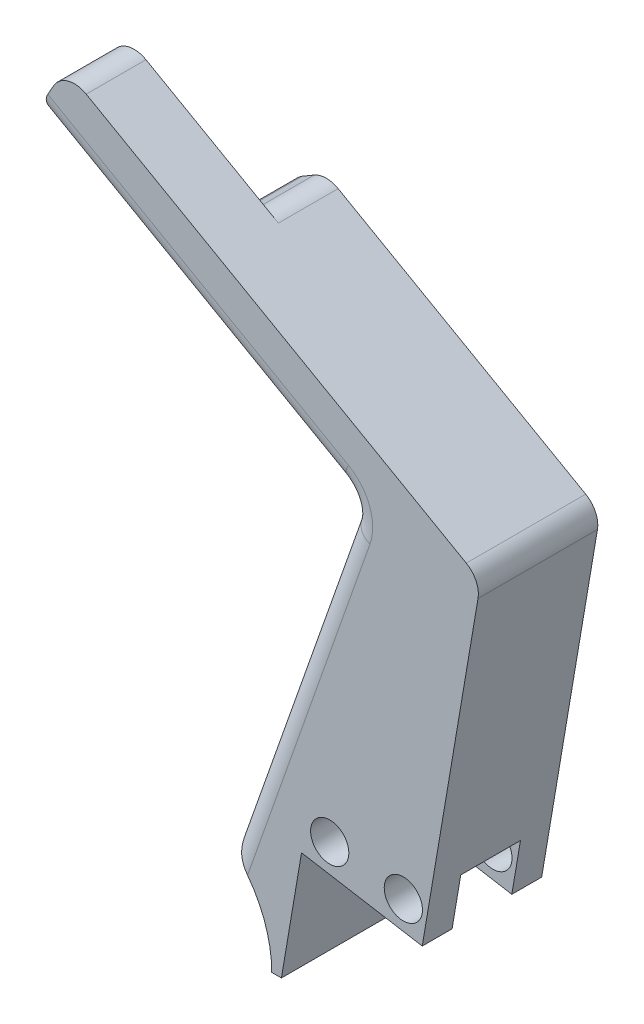
ISO-10303-21;
HEADER;
FILE_DESCRIPTION(('STEP AP214'),'2;1');
FILE_NAME('part.step','',(''),(''),'','','');
FILE_SCHEMA(('AUTOMOTIVE_DESIGN { 1 0 10303 214 1 1 1 1 }'));
ENDSEC;
DATA;
#1=APPLICATION_CONTEXT('core data for automotive mechanical design processes');
#2=APPLICATION_PROTOCOL_DEFINITION('international standard','automotive_design',2000,#1);
#3=PRODUCT_CONTEXT('',#1,'mechanical');
#4=PRODUCT('Part','Part','',(#3));
#5=PRODUCT_RELATED_PRODUCT_CATEGORY('part','',(#4));
#6=PRODUCT_DEFINITION_FORMATION('','',#4);
#7=PRODUCT_DEFINITION_CONTEXT('part definition',#1,'design');
#8=PRODUCT_DEFINITION('design','',#6,#7);
#9=PRODUCT_DEFINITION_SHAPE('','',#8);
#10=(LENGTH_UNIT() NAMED_UNIT(*) SI_UNIT(.MILLI.,.METRE.));
#11=(NAMED_UNIT(*) PLANE_ANGLE_UNIT() SI_UNIT($,.RADIAN.));
#12=(NAMED_UNIT(*) SI_UNIT($,.STERADIAN.) SOLID_ANGLE_UNIT());
#13=UNCERTAINTY_MEASURE_WITH_UNIT(LENGTH_MEASURE(1.E-05),#10,'distance_accuracy_value','');
#14=(GEOMETRIC_REPRESENTATION_CONTEXT(3) GLOBAL_UNCERTAINTY_ASSIGNED_CONTEXT((#13)) GLOBAL_UNIT_ASSIGNED_CONTEXT((#10,
#11,#12)) REPRESENTATION_CONTEXT('',''));
#15=CARTESIAN_POINT('',(0.,0.,0.));
#16=DIRECTION('',(0.,0.,1.));
#17=DIRECTION('',(1.,0.,0.));
#18=AXIS2_PLACEMENT_3D('',#15,#16,#17);
#19=CARTESIAN_POINT('',(-126.876351036377,72.1518716570229,12.7));
#20=DIRECTION('',(0.869270995560934,-0.494335853723461,0.));
#21=DIRECTION('',(0.494335853723461,0.869270995560934,0.));
#22=AXIS2_PLACEMENT_3D('',#19,#20,#21);
#23=PLANE('',#22);
#24=DIRECTION('',(-0.494335853723461,-0.869270995560934,0.));
#25=VECTOR('',#24,1.);
#26=CARTESIAN_POINT('',(-126.876351036377,72.1518716570229,12.7));
#27=LINE('',#26,#25);
#28=CARTESIAN_POINT('',(-97.1971657462799,124.341602080649,12.7));
#29=VERTEX_POINT('',#28);
#30=CARTESIAN_POINT('',(-97.8249722805087,123.237627916286,12.7));
#31=VERTEX_POINT('',#30);
#32=EDGE_CURVE('E291',#29,#31,#27,.T.);
#33=ORIENTED_EDGE('',*,*,#32,.F.);
#34=DIRECTION('',(0.,0.,-1.));
#35=VECTOR('',#34,1.);
#36=CARTESIAN_POINT('',(-97.1971657462799,124.341602080649,12.7));
#37=LINE('',#36,#35);
#38=CARTESIAN_POINT('',(-97.1971657462799,124.341602080649,6.35));
#39=VERTEX_POINT('',#38);
#40=EDGE_CURVE('E545',#29,#39,#37,.T.);
#41=ORIENTED_EDGE('',*,*,#40,.T.);
#42=DIRECTION('',(0.49433585372346,0.869270995560934,0.));
#43=VECTOR('',#42,1.);
#44=CARTESIAN_POINT('',(-99.0805853489663,121.029679587561,6.35));
#45=LINE('',#44,#43);
#46=CARTESIAN_POINT('',(-97.8249722805087,123.237627916286,6.35));
#47=VERTEX_POINT('',#46);
#48=EDGE_CURVE('E605',#47,#39,#45,.T.);
#49=ORIENTED_EDGE('',*,*,#48,.F.);
#50=DIRECTION('',(0.,0.,-1.));
#51=VECTOR('',#50,1.);
#52=CARTESIAN_POINT('',(-97.8249722805087,123.237627916286,12.7));
#53=LINE('',#52,#51);
#54=EDGE_CURVE('E542',#47,#31,#53,.F.);
#55=ORIENTED_EDGE('',*,*,#54,.T.);
#56=EDGE_LOOP('',(#33,#41,#49,#55));
#57=FACE_BOUND('',#56,.T.);
#58=ADVANCED_FACE('F42',(#57),#23,.F.);
#59=CARTESIAN_POINT('',(9.04672981043055,53.3404602038047,12.7));
#60=DIRECTION('',(-0.167215563443236,-0.985920359533345,0.));
#61=DIRECTION('',(0.985920359533346,-0.167215563443236,0.));
#62=AXIS2_PLACEMENT_3D('',#59,#60,#61);
#63=PLANE('',#62);
#64=DIRECTION('',(0.,0.,-1.));
#65=VECTOR('',#64,1.);
#66=CARTESIAN_POINT('',(-58.0110371701051,64.7136935288603,12.7));
#67=LINE('',#66,#65);
#68=CARTESIAN_POINT('',(-58.0110371701051,64.7136935288603,3.175));
#69=VERTEX_POINT('',#68);
#70=CARTESIAN_POINT('',(-58.0110371701051,64.7136935288603,0.));
#71=VERTEX_POINT('',#70);
#72=EDGE_CURVE('E345',#69,#71,#67,.T.);
#73=ORIENTED_EDGE('',*,*,#72,.F.);
#74=DIRECTION('',(0.985920359533345,-0.167215563443238,0.));
#75=VECTOR('',#74,1.);
#76=CARTESIAN_POINT('',(-79.1264514007262,68.294942109204,3.175));
#77=LINE('',#76,#75);
#78=CARTESIAN_POINT('',(-70.8452554503304,66.8904221259827,3.175));
#79=VERTEX_POINT('',#78);
#80=EDGE_CURVE('E237',#79,#69,#77,.T.);
#81=ORIENTED_EDGE('',*,*,#80,.F.);
#82=DIRECTION('',(0.,0.,-1.));
#83=VECTOR('',#82,1.);
#84=CARTESIAN_POINT('',(-70.8452554503304,66.8904221259827,12.7));
#85=LINE('',#84,#83);
#86=CARTESIAN_POINT('',(-70.8452554503304,66.8904221259827,0.));
#87=VERTEX_POINT('',#86);
#88=EDGE_CURVE('E349',#79,#87,#85,.T.);
#89=ORIENTED_EDGE('',*,*,#88,.T.);
#90=DIRECTION('',(-0.985920359533345,0.167215563443236,0.));
#91=VECTOR('',#90,1.);
#92=CARTESIAN_POINT('',(9.04672981043055,53.3404602038047,0.));
#93=LINE('',#92,#91);
#94=EDGE_CURVE('E314',#71,#87,#93,.T.);
#95=ORIENTED_EDGE('',*,*,#94,.F.);
#96=EDGE_LOOP('',(#73,#81,#89,#95));
#97=FACE_BOUND('',#96,.T.);
#98=ADVANCED_FACE('F465',(#97),#63,.T.);
#99=CARTESIAN_POINT('',(-67.846388340809,69.3820809777967,12.7));
#100=DIRECTION('',(0.,0.,-1.));
#101=DIRECTION('',(-1.,0.,0.));
#102=AXIS2_PLACEMENT_3D('',#99,#100,#101);
#103=CYLINDRICAL_SURFACE('',#102,2.03200000000253);
#104=CARTESIAN_POINT('',(-67.846388340809,69.3820809777967,0.));
#105=DIRECTION('',(0.,0.,1.));
#106=DIRECTION('',(1.,0.,0.));
#107=AXIS2_PLACEMENT_3D('',#104,#105,#106);
#108=CIRCLE('',#107,2.03200000000253);
#109=CARTESIAN_POINT('',(-65.8143883408065,69.3820809777967,0.));
#110=VERTEX_POINT('',#109);
#111=EDGE_CURVE('E333',#110,#110,#108,.T.);
#112=ORIENTED_EDGE('',*,*,#111,.F.);
#113=EDGE_LOOP('',(#112));
#114=FACE_BOUND('',#113,.T.);
#115=CARTESIAN_POINT('',(-67.846388340809,69.3820809777967,3.175));
#116=DIRECTION('',(0.,0.,1.));
#117=DIRECTION('',(0.,-1.,0.));
#118=AXIS2_PLACEMENT_3D('',#115,#116,#117);
#119=CIRCLE('',#118,2.03200000000253);
#120=CARTESIAN_POINT('',(-67.846388340809,67.3500809777942,3.17499999999999));
#121=VERTEX_POINT('',#120);
#122=EDGE_CURVE('E264',#121,#121,#119,.T.);
#123=ORIENTED_EDGE('',*,*,#122,.T.);
#124=EDGE_LOOP('',(#123));
#125=FACE_BOUND('',#124,.T.);
#126=ADVANCED_FACE('F473',(#114,#125),#103,.F.);
#127=CARTESIAN_POINT('',(-60.020645487013,68.0548074429664,12.7));
#128=DIRECTION('',(0.,0.,-1.));
#129=DIRECTION('',(-1.,0.,0.));
#130=AXIS2_PLACEMENT_3D('',#127,#128,#129);
#131=CYLINDRICAL_SURFACE('',#130,2.03200000000253);
#132=CARTESIAN_POINT('',(-60.020645487013,68.0548074429664,0.));
#133=DIRECTION('',(0.,0.,1.));
#134=DIRECTION('',(1.,0.,0.));
#135=AXIS2_PLACEMENT_3D('',#132,#133,#134);
#136=CIRCLE('',#135,2.03200000000253);
#137=CARTESIAN_POINT('',(-57.9886454870105,68.0548074429664,0.));
#138=VERTEX_POINT('',#137);
#139=EDGE_CURVE('E280',#138,#138,#136,.T.);
#140=ORIENTED_EDGE('',*,*,#139,.F.);
#141=EDGE_LOOP('',(#140));
#142=FACE_BOUND('',#141,.T.);
#143=CARTESIAN_POINT('',(-60.020645487013,68.0548074429664,3.175));
#144=DIRECTION('',(0.,0.,1.));
#145=DIRECTION('',(0.,-1.,0.));
#146=AXIS2_PLACEMENT_3D('',#143,#144,#145);
#147=CIRCLE('',#146,2.03200000000253);
#148=CARTESIAN_POINT('',(-60.020645487013,66.0228074429639,3.17499999999999));
#149=VERTEX_POINT('',#148);
#150=EDGE_CURVE('E269',#149,#149,#147,.T.);
#151=ORIENTED_EDGE('',*,*,#150,.T.);
#152=EDGE_LOOP('',(#151));
#153=FACE_BOUND('',#152,.T.);
#154=ADVANCED_FACE('F491',(#142,#153),#131,.F.);
#155=CARTESIAN_POINT('',(-79.891985260761,13.5499619221781,12.7));
#156=DIRECTION('',(0.985920359533345,-0.167215563443238,0.));
#157=DIRECTION('',(0.167215563443238,0.985920359533345,0.));
#158=AXIS2_PLACEMENT_3D('',#155,#156,#157);
#159=PLANE('',#158);
#160=DIRECTION('',(-0.167215563443238,-0.985920359533345,0.));
#161=VECTOR('',#160,1.);
#162=CARTESIAN_POINT('',(-79.891985260761,13.5499619221781,0.));
#163=LINE('',#162,#161);
#164=CARTESIAN_POINT('',(-72.9824191211867,54.2894827674432,0.));
#165=VERTEX_POINT('',#164);
#166=EDGE_CURVE('E274',#87,#165,#163,.T.);
#167=ORIENTED_EDGE('',*,*,#166,.F.);
#168=ORIENTED_EDGE('',*,*,#88,.F.);
#169=DIRECTION('',(0.167215563443238,0.985920359533345,0.));
#170=VECTOR('',#169,1.);
#171=CARTESIAN_POINT('',(-79.891985260761,13.5499619221781,3.17499999999998));
#172=LINE('',#171,#170);
#173=CARTESIAN_POINT('',(-69.925898522875,72.3110462221601,3.175));
#174=VERTEX_POINT('',#173);
#175=EDGE_CURVE('E358',#79,#174,#172,.T.);
#176=ORIENTED_EDGE('',*,*,#175,.T.);
#177=DIRECTION('',(0.,0.,1.));
#178=VECTOR('',#177,1.);
#179=CARTESIAN_POINT('',(-69.925898522875,72.3110462221601,0.));
#180=LINE('',#179,#178);
#181=CARTESIAN_POINT('',(-69.925898522875,72.3110462221601,9.525));
#182=VERTEX_POINT('',#181);
#183=EDGE_CURVE('E226',#174,#182,#180,.T.);
#184=ORIENTED_EDGE('',*,*,#183,.T.);
#185=DIRECTION('',(0.167215563443238,0.985920359533345,0.));
#186=VECTOR('',#185,1.);
#187=CARTESIAN_POINT('',(-79.891985260761,13.5499619221781,9.52499999999998));
#188=LINE('',#187,#186);
#189=CARTESIAN_POINT('',(-70.8452554503304,66.8904221259827,9.525));
#190=VERTEX_POINT('',#189);
#191=EDGE_CURVE('E263',#190,#182,#188,.T.);
#192=ORIENTED_EDGE('',*,*,#191,.F.);
#193=CARTESIAN_POINT('',(-70.8452554503304,66.8904221259827,12.7));
#194=VERTEX_POINT('',#193);
#195=EDGE_CURVE('E350',#194,#190,#85,.T.);
#196=ORIENTED_EDGE('',*,*,#195,.F.);
#197=DIRECTION('',(-0.167215563443238,-0.985920359533345,0.));
#198=VECTOR('',#197,1.);
#199=CARTESIAN_POINT('',(-79.891985260761,13.5499619221781,12.7));
#200=LINE('',#199,#198);
#201=CARTESIAN_POINT('',(-72.9824191211867,54.2894827674432,12.7));
#202=VERTEX_POINT('',#201);
#203=EDGE_CURVE('E275',#194,#202,#200,.T.);
#204=ORIENTED_EDGE('',*,*,#203,.T.);
#205=DIRECTION('',(0.,0.,-1.));
#206=VECTOR('',#205,1.);
#207=CARTESIAN_POINT('',(-72.9824191211867,54.2894827674432,12.7));
#208=LINE('',#207,#206);
#209=EDGE_CURVE('E310',#202,#165,#208,.T.);
#210=ORIENTED_EDGE('',*,*,#209,.T.);
#211=EDGE_LOOP('',(#167,#168,#176,#184,#192,#196,#204,#210));
#212=FACE_BOUND('',#211,.T.);
#213=ADVANCED_FACE('F487',(#212),#159,.T.);
#214=DIRECTION('',(0.985920359533345,-0.167215563443238,0.));
#215=VECTOR('',#214,1.);
#216=CARTESIAN_POINT('',(-79.1264514007262,68.294942109204,9.525));
#217=LINE('',#216,#215);
#218=CARTESIAN_POINT('',(-58.0110371701051,64.7136935288603,9.525));
#219=VERTEX_POINT('',#218);
#220=EDGE_CURVE('E255',#190,#219,#217,.T.);
#221=ORIENTED_EDGE('',*,*,#220,.T.);
#222=CARTESIAN_POINT('',(-58.0110371701051,64.7136935288603,12.7));
#223=VERTEX_POINT('',#222);
#224=EDGE_CURVE('E346',#223,#219,#67,.T.);
#225=ORIENTED_EDGE('',*,*,#224,.F.);
#226=DIRECTION('',(-0.985920359533345,0.167215563443236,0.));
#227=VECTOR('',#226,1.);
#228=CARTESIAN_POINT('',(9.04672981043055,53.3404602038047,12.7));
#229=LINE('',#228,#227);
#230=EDGE_CURVE('E279',#223,#194,#229,.T.);
#231=ORIENTED_EDGE('',*,*,#230,.T.);
#232=ORIENTED_EDGE('',*,*,#195,.T.);
#233=EDGE_LOOP('',(#221,#225,#231,#232));
#234=FACE_BOUND('',#233,.T.);
#235=ADVANCED_FACE('F476',(#234),#63,.T.);
#236=CARTESIAN_POINT('',(-67.0577669805357,11.3732333250558,12.7));
#237=DIRECTION('',(0.985920359533345,-0.167215563443238,0.));
#238=DIRECTION('',(0.167215563443238,0.985920359533345,0.));
#239=AXIS2_PLACEMENT_3D('',#236,#237,#238);
#240=PLANE('',#239);
#241=DIRECTION('',(-0.167215563443238,-0.985920359533345,0.));
#242=VECTOR('',#241,1.);
#243=CARTESIAN_POINT('',(-67.0577669805357,11.3732333250558,0.));
#244=LINE('',#243,#242);
#245=CARTESIAN_POINT('',(-52.0799835223204,99.6838029159595,0.));
#246=VERTEX_POINT('',#245);
#247=EDGE_CURVE('E318',#246,#71,#244,.T.);
#248=ORIENTED_EDGE('',*,*,#247,.F.);
#249=DIRECTION('',(0.,0.,-1.));
#250=VECTOR('',#249,1.);
#251=CARTESIAN_POINT('',(-52.0799835223204,99.6838029159595,12.7));
#252=LINE('',#251,#250);
#253=CARTESIAN_POINT('',(-52.0799835223204,99.6838029159595,12.7));
#254=VERTEX_POINT('',#253);
#255=EDGE_CURVE('E532',#246,#254,#252,.F.);
#256=ORIENTED_EDGE('',*,*,#255,.T.);
#257=DIRECTION('',(-0.167215563443238,-0.985920359533345,0.));
#258=VECTOR('',#257,1.);
#259=CARTESIAN_POINT('',(-67.0577669805357,11.3732333250558,12.7));
#260=LINE('',#259,#258);
#261=EDGE_CURVE('E284',#254,#223,#260,.T.);
#262=ORIENTED_EDGE('',*,*,#261,.T.);
#263=ORIENTED_EDGE('',*,*,#224,.T.);
#264=DIRECTION('',(-0.167215563443238,-0.985920359533345,0.));
#265=VECTOR('',#264,1.);
#266=CARTESIAN_POINT('',(-67.0577669805357,11.3732333250558,9.52499999999998));
#267=LINE('',#266,#265);
#268=CARTESIAN_POINT('',(-57.0916802426497,70.1343176250378,9.525));
#269=VERTEX_POINT('',#268);
#270=EDGE_CURVE('E231',#269,#219,#267,.T.);
#271=ORIENTED_EDGE('',*,*,#270,.F.);
#272=DIRECTION('',(0.,0.,-1.));
#273=VECTOR('',#272,1.);
#274=CARTESIAN_POINT('',(-57.0916802426497,70.1343176250378,0.));
#275=LINE('',#274,#273);
#276=CARTESIAN_POINT('',(-57.0916802426497,70.1343176250378,3.175));
#277=VERTEX_POINT('',#276);
#278=EDGE_CURVE('E223',#269,#277,#275,.T.);
#279=ORIENTED_EDGE('',*,*,#278,.T.);
#280=DIRECTION('',(-0.167215563443238,-0.985920359533345,0.));
#281=VECTOR('',#280,1.);
#282=CARTESIAN_POINT('',(-67.0577669805357,11.3732333250558,3.17499999999998));
#283=LINE('',#282,#281);
#284=EDGE_CURVE('E234',#277,#69,#283,.T.);
#285=ORIENTED_EDGE('',*,*,#284,.T.);
#286=ORIENTED_EDGE('',*,*,#72,.T.);
#287=EDGE_LOOP('',(#248,#256,#262,#263,#271,#279,#285,#286));
#288=FACE_BOUND('',#287,.T.);
#289=ADVANCED_FACE('F245',(#288),#240,.T.);
#290=CARTESIAN_POINT('',(30.9347983585548,54.3976787523503,12.7));
#291=DIRECTION('',(-0.494335853723461,-0.869270995560933,0.));
#292=DIRECTION('',(0.869270995560934,-0.494335853723462,0.));
#293=AXIS2_PLACEMENT_3D('',#290,#291,#292);
#294=PLANE('',#293);
#295=DIRECTION('',(-0.869270995560934,0.494335853723462,0.));
#296=VECTOR('',#295,1.);
#297=CARTESIAN_POINT('',(30.9347983585548,54.3976787523503,12.7));
#298=LINE('',#297,#296);
#299=CARTESIAN_POINT('',(-53.3286081670775,102.31647877583,12.7));
#300=VERTEX_POINT('',#299);
#301=CARTESIAN_POINT('',(-93.7336043490976,125.293937340916,12.7));
#302=VERTEX_POINT('',#301);
#303=EDGE_CURVE('E287',#300,#302,#298,.T.);
#304=ORIENTED_EDGE('',*,*,#303,.F.);
#305=DIRECTION('',(0.,0.,-1.));
#306=VECTOR('',#305,1.);
#307=CARTESIAN_POINT('',(-53.3286081670775,102.31647877583,0.));
#308=LINE('',#307,#306);
#309=CARTESIAN_POINT('',(-53.3286081670775,102.31647877583,0.));
#310=VERTEX_POINT('',#309);
#311=EDGE_CURVE('E528',#300,#310,#308,.T.);
#312=ORIENTED_EDGE('',*,*,#311,.T.);
#313=DIRECTION('',(-0.869270995560934,0.494335853723462,0.));
#314=VECTOR('',#313,1.);
#315=CARTESIAN_POINT('',(30.9347983585548,54.3976787523503,0.));
#316=LINE('',#315,#314);
#317=CARTESIAN_POINT('',(-79.6527444805479,117.28645300079,0.));
#318=VERTEX_POINT('',#317);
#319=EDGE_CURVE('E321',#310,#318,#316,.T.);
#320=ORIENTED_EDGE('',*,*,#319,.T.);
#321=DIRECTION('',(0.,0.,-1.));
#322=VECTOR('',#321,1.);
#323=CARTESIAN_POINT('',(-79.6527444805479,117.28645300079,12.7));
#324=LINE('',#323,#322);
#325=CARTESIAN_POINT('',(-79.6527444805479,117.28645300079,6.35));
#326=VERTEX_POINT('',#325);
#327=EDGE_CURVE('E524',#318,#326,#324,.F.);
#328=ORIENTED_EDGE('',*,*,#327,.T.);
#329=DIRECTION('',(0.869270995560933,-0.494335853723462,0.));
#330=VECTOR('',#329,1.);
#331=CARTESIAN_POINT('',(-80.9275040424939,118.011381543862,6.35));
#332=LINE('',#331,#330);
#333=CARTESIAN_POINT('',(-93.7336043490976,125.293937340916,6.35));
#334=VERTEX_POINT('',#333);
#335=EDGE_CURVE('E853',#334,#326,#332,.T.);
#336=ORIENTED_EDGE('',*,*,#335,.F.);
#337=DIRECTION('',(0.,0.,-1.));
#338=VECTOR('',#337,1.);
#339=CARTESIAN_POINT('',(-93.7336043490976,125.293937340916,12.7));
#340=LINE('',#339,#338);
#341=EDGE_CURVE('E521',#334,#302,#340,.F.);
#342=ORIENTED_EDGE('',*,*,#341,.T.);
#343=EDGE_LOOP('',(#304,#312,#320,#328,#336,#342));
#344=FACE_BOUND('',#343,.T.);
#345=ADVANCED_FACE('F481',(#344),#294,.F.);
#346=CARTESIAN_POINT('',(27.7957656874108,48.8778079305384,12.7));
#347=DIRECTION('',(-0.494335853723461,-0.869270995560934,0.));
#348=DIRECTION('',(0.869270995560934,-0.494335853723461,0.));
#349=AXIS2_PLACEMENT_3D('',#346,#347,#348);
#350=PLANE('',#349);
#351=DIRECTION('',(-0.869270995560934,0.494335853723461,0.));
#352=VECTOR('',#351,1.);
#353=CARTESIAN_POINT('',(27.7957656874108,48.8778079305384,10.16));
#354=LINE('',#353,#352);
#355=CARTESIAN_POINT('',(-67.1015061573076,102.843860097176,10.16));
#356=VERTEX_POINT('',#355);
#357=CARTESIAN_POINT('',(-96.8726370202415,119.774066519104,10.16));
#358=VERTEX_POINT('',#357);
#359=EDGE_CURVE('E370',#356,#358,#354,.T.);
#360=ORIENTED_EDGE('',*,*,#359,.T.);
#361=DIRECTION('',(0.,0.,-1.));
#362=VECTOR('',#361,1.);
#363=CARTESIAN_POINT('',(-96.8726370202415,119.774066519104,6.35));
#364=LINE('',#363,#362);
#365=CARTESIAN_POINT('',(-96.8726370202415,119.774066519104,6.35));
#366=VERTEX_POINT('',#365);
#367=EDGE_CURVE('E374',#358,#366,#364,.T.);
#368=ORIENTED_EDGE('',*,*,#367,.T.);
#369=DIRECTION('',(-0.869270995560934,0.49433585372346,0.));
#370=VECTOR('',#369,1.);
#371=CARTESIAN_POINT('',(-87.253435618503,114.30383207973,6.35));
#372=LINE('',#371,#370);
#373=CARTESIAN_POINT('',(-83.4291569326649,112.129046450514,6.35));
#374=VERTEX_POINT('',#373);
#375=EDGE_CURVE('E599',#374,#366,#372,.T.);
#376=ORIENTED_EDGE('',*,*,#375,.F.);
#377=DIRECTION('',(0.,0.,-1.));
#378=VECTOR('',#377,1.);
#379=CARTESIAN_POINT('',(-83.4291569326649,112.129046450514,0.));
#380=LINE('',#379,#378);
#381=CARTESIAN_POINT('',(-83.4291569326649,112.129046450514,2.54));
#382=VERTEX_POINT('',#381);
#383=EDGE_CURVE('E354',#374,#382,#380,.T.);
#384=ORIENTED_EDGE('',*,*,#383,.T.);
#385=DIRECTION('',(-0.869270995560934,0.494335853723461,0.));
#386=VECTOR('',#385,1.);
#387=CARTESIAN_POINT('',(-65.2568084440015,101.794819897255,2.54));
#388=LINE('',#387,#386);
#389=CARTESIAN_POINT('',(-67.1015061573076,102.843860097176,2.54));
#390=VERTEX_POINT('',#389);
#391=EDGE_CURVE('E364',#382,#390,#388,.F.);
#392=ORIENTED_EDGE('',*,*,#391,.T.);
#393=DIRECTION('',(0.,0.,-1.));
#394=VECTOR('',#393,1.);
#395=CARTESIAN_POINT('',(-67.1015061573076,102.843860097176,12.7));
#396=LINE('',#395,#394);
#397=EDGE_CURVE('E367',#390,#356,#396,.F.);
#398=ORIENTED_EDGE('',*,*,#397,.T.);
#399=EDGE_LOOP('',(#360,#368,#376,#384,#392,#398));
#400=FACE_BOUND('',#399,.T.);
#401=ADVANCED_FACE('F480',(#400),#350,.T.);
#402=CARTESIAN_POINT('',(-89.9374890122914,31.6405176227048,12.7));
#403=DIRECTION('',(0.943326032861359,-0.331867436977554,0.));
#404=DIRECTION('',(0.331867436977554,0.943326032861359,0.));
#405=AXIS2_PLACEMENT_3D('',#402,#403,#404);
#406=PLANE('',#405);
#407=DIRECTION('',(-0.331867436977554,-0.943326032861359,0.));
#408=VECTOR('',#407,1.);
#409=CARTESIAN_POINT('',(-65.2568084440014,101.794819897255,10.16));
#410=LINE('',#409,#408);
#411=CARTESIAN_POINT('',(-78.0010830031845,65.5694942940583,10.16));
#412=VERTEX_POINT('',#411);
#413=CARTESIAN_POINT('',(-65.9610711022973,99.7929684785281,10.16));
#414=VERTEX_POINT('',#413);
#415=EDGE_CURVE('E418',#412,#414,#410,.F.);
#416=ORIENTED_EDGE('',*,*,#415,.T.);
#417=DIRECTION('',(0.,0.,-1.));
#418=VECTOR('',#417,1.);
#419=CARTESIAN_POINT('',(-65.9610711022973,99.7929684785282,12.7));
#420=LINE('',#419,#418);
#421=CARTESIAN_POINT('',(-65.9610711022973,99.7929684785281,2.54));
#422=VERTEX_POINT('',#421);
#423=EDGE_CURVE('E421',#414,#422,#420,.T.);
#424=ORIENTED_EDGE('',*,*,#423,.T.);
#425=DIRECTION('',(-0.331867436977554,-0.943326032861359,0.));
#426=VECTOR('',#425,1.);
#427=CARTESIAN_POINT('',(-89.9374890122914,31.6405176227048,2.54));
#428=LINE('',#427,#426);
#429=CARTESIAN_POINT('',(-78.0010830031845,65.5694942940583,2.54));
#430=VERTEX_POINT('',#429);
#431=EDGE_CURVE('E412',#422,#430,#428,.T.);
#432=ORIENTED_EDGE('',*,*,#431,.T.);
#433=DIRECTION('',(0.,0.,1.));
#434=VECTOR('',#433,1.);
#435=CARTESIAN_POINT('',(-78.0010830031845,65.5694942940583,12.7));
#436=LINE('',#435,#434);
#437=EDGE_CURVE('E415',#430,#412,#436,.T.);
#438=ORIENTED_EDGE('',*,*,#437,.T.);
#439=EDGE_LOOP('',(#416,#424,#432,#438));
#440=FACE_BOUND('',#439,.T.);
#441=ADVANCED_FACE('F651',(#440),#406,.F.);
#442=CARTESIAN_POINT('',(-86.7102231546913,54.2894827674432,12.7));
#443=DIRECTION('',(0.,0.,-1.));
#444=DIRECTION('',(-1.,0.,0.));
#445=AXIS2_PLACEMENT_3D('',#442,#443,#444);
#446=CYLINDRICAL_SURFACE('',#445,12.7);
#447=CARTESIAN_POINT('',(-86.7102231546913,54.2894827674432,12.7));
#448=DIRECTION('',(0.,0.,1.));
#449=DIRECTION('',(1.,0.,0.));
#450=AXIS2_PLACEMENT_3D('',#447,#448,#449);
#451=CIRCLE('',#450,12.7);
#452=CARTESIAN_POINT('',(-74.0102231546913,54.2894827674432,12.7));
#453=VERTEX_POINT('',#452);
#454=CARTESIAN_POINT('',(-76.5814908906041,61.9509958505384,12.7));
#455=VERTEX_POINT('',#454);
#456=EDGE_CURVE('E295',#453,#455,#451,.T.);
#457=ORIENTED_EDGE('',*,*,#456,.T.);
#458=CARTESIAN_POINT('',(-76.5814908906041,61.9509958505384,12.7));
#459=CARTESIAN_POINT('',(-76.635358110298,62.022224265969,12.7000029841169));
#460=CARTESIAN_POINT('',(-76.6900062409456,62.0928952378227,12.6967259269565));
#461=CARTESIAN_POINT('',(-76.8005249421697,62.2327678211011,12.6833402874415));
#462=CARTESIAN_POINT('',(-76.8563970719978,62.3019673068701,12.6732224341842));
#463=CARTESIAN_POINT('',(-76.9678006409954,62.4370428815018,12.6461436602015));
#464=CARTESIAN_POINT('',(-77.0233181718973,62.5029572149658,12.6293172650827));
#465=CARTESIAN_POINT('',(-77.1345270681231,62.6323424570819,12.5886314485851));
#466=CARTESIAN_POINT('',(-77.1902182338827,62.6958154956421,12.5647783226141));
#467=CARTESIAN_POINT('',(-77.2809007624717,62.797165521864,12.5199439788999));
#468=CARTESIAN_POINT('',(-77.3160037291731,62.8359035375677,12.5011100798247));
#469=CARTESIAN_POINT('',(-77.3861171076249,62.9123453763795,12.4604126952739));
#470=CARTESIAN_POINT('',(-77.4211256420375,62.9500414304694,12.4385313948372));
#471=CARTESIAN_POINT('',(-77.4558995922125,62.9870396313533,12.4151680907318));
#472=B_SPLINE_CURVE_WITH_KNOTS('',3,(#458,#459,#460,#461,#462,#463,#464,#465,#466,#467,#468,
#469,#470,#471),.UNSPECIFIED.,.F.,.F.,(4,2,2,2,2,2,4),(0.,0.267886867492367,0.53613751494229,
0.799259680159853,1.06214682150762,1.2287602065536,1.3963920336943),.UNSPECIFIED.);
#473=CARTESIAN_POINT('',(-77.4558995922125,62.9870396313533,12.4151680907318));
#474=VERTEX_POINT('',#473);
#475=EDGE_CURVE('E514',#455,#474,#472,.T.);
#476=ORIENTED_EDGE('',*,*,#475,.T.);
#477=DIRECTION('',(0.,0.,-1.));
#478=VECTOR('',#477,1.);
#479=CARTESIAN_POINT('',(-77.4558995922125,62.9870396313533,12.7));
#480=LINE('',#479,#478);
#481=CARTESIAN_POINT('',(-77.4558995922125,62.9870396313533,0.28483190926815));
#482=VERTEX_POINT('',#481);
#483=EDGE_CURVE('E434',#474,#482,#480,.T.);
#484=ORIENTED_EDGE('',*,*,#483,.T.);
#485=CARTESIAN_POINT('',(-77.4558995922125,62.9870396313533,0.28483190926815));
#486=CARTESIAN_POINT('',(-77.4002944094285,62.9278899930757,0.247466657813737));
#487=CARTESIAN_POINT('',(-77.3440974220077,62.8669447561053,0.213905976097971));
#488=CARTESIAN_POINT('',(-77.2311863322217,62.7419899018284,0.154280527623066));
#489=CARTESIAN_POINT('',(-77.1744724529485,62.677981560163,0.128212671598624));
#490=CARTESIAN_POINT('',(-77.0621370082808,62.5485184862189,0.0838201951775592));
#491=CARTESIAN_POINT('',(-77.0065136695586,62.4831085589004,0.0653682543232706));
#492=CARTESIAN_POINT('',(-76.8958788615937,62.3502587402846,0.0353587890503809));
#493=CARTESIAN_POINT('',(-76.840867202589,62.2828195040502,0.0237990643728269));
#494=CARTESIAN_POINT('',(-76.7518511245527,62.1713538209635,0.0103456933053708));
#495=CARTESIAN_POINT('',(-76.7175353009953,62.1278031010434,0.00646225269770109));
#496=CARTESIAN_POINT('',(-76.64920998918,62.0399107987647,0.00128224109059535));
#497=CARTESIAN_POINT('',(-76.6152033411531,61.9955661322837,4.62845760425897E-07));
#498=CARTESIAN_POINT('',(-76.5814908906041,61.9509958505384,0.));
#499=B_SPLINE_CURVE_WITH_KNOTS('',3,(#485,#486,#487,#488,#489,#490,#491,#492,#493,#494,#495,
#496,#497,#498),.UNSPECIFIED.,.F.,.F.,(4,2,2,2,2,2,4),(0.,0.267957936166307,0.535805235239914,
0.798973161070482,1.06205702858998,1.22874165000929,1.39637139576019),.UNSPECIFIED.);
#500=CARTESIAN_POINT('',(-76.5814908906041,61.9509958505384,0.));
#501=VERTEX_POINT('',#500);
#502=EDGE_CURVE('E425',#482,#501,#499,.T.);
#503=ORIENTED_EDGE('',*,*,#502,.T.);
#504=CARTESIAN_POINT('',(-86.7102231546913,54.2894827674432,0.));
#505=DIRECTION('',(0.,0.,1.));
#506=DIRECTION('',(1.,0.,0.));
#507=AXIS2_PLACEMENT_3D('',#504,#505,#506);
#508=CIRCLE('',#507,12.7);
#509=CARTESIAN_POINT('',(-74.0102231546913,54.2894827674432,0.));
#510=VERTEX_POINT('',#509);
#511=EDGE_CURVE('E325',#510,#501,#508,.T.);
#512=ORIENTED_EDGE('',*,*,#511,.F.);
#513=DIRECTION('',(0.,0.,-1.));
#514=VECTOR('',#513,1.);
#515=CARTESIAN_POINT('',(-74.0102231546913,54.2894827674432,12.7));
#516=LINE('',#515,#514);
#517=EDGE_CURVE('E342',#453,#510,#516,.T.);
#518=ORIENTED_EDGE('',*,*,#517,.F.);
#519=EDGE_LOOP('',(#457,#476,#484,#503,#512,#518));
#520=FACE_BOUND('',#519,.T.);
#521=ADVANCED_FACE('F436',(#520),#446,.F.);
#522=CARTESIAN_POINT('',(-67.846388340809,69.3820809777967,9.525));
#523=DIRECTION('',(0.,0.,1.));
#524=DIRECTION('',(0.,-1.,0.));
#525=AXIS2_PLACEMENT_3D('',#522,#523,#524);
#526=CIRCLE('',#525,2.03200000000253);
#527=CARTESIAN_POINT('',(-67.846388340809,67.3500809777942,9.525));
#528=VERTEX_POINT('',#527);
#529=EDGE_CURVE('E270',#528,#528,#526,.T.);
#530=ORIENTED_EDGE('',*,*,#529,.F.);
#531=EDGE_LOOP('',(#530));
#532=FACE_BOUND('',#531,.T.);
#533=CARTESIAN_POINT('',(-67.846388340809,69.3820809777967,12.7));
#534=DIRECTION('',(0.,0.,1.));
#535=DIRECTION('',(1.,0.,0.));
#536=AXIS2_PLACEMENT_3D('',#533,#534,#535);
#537=CIRCLE('',#536,2.03200000000253);
#538=CARTESIAN_POINT('',(-65.8143883408065,69.3820809777967,12.7));
#539=VERTEX_POINT('',#538);
#540=EDGE_CURVE('E302',#539,#539,#537,.T.);
#541=ORIENTED_EDGE('',*,*,#540,.T.);
#542=EDGE_LOOP('',(#541));
#543=FACE_BOUND('',#542,.T.);
#544=ADVANCED_FACE('F746',(#532,#543),#103,.F.);
#545=CARTESIAN_POINT('',(0.,54.2894827674432,12.7));
#546=DIRECTION('',(0.,1.,0.));
#547=DIRECTION('',(0.,0.,1.));
#548=AXIS2_PLACEMENT_3D('',#545,#546,#547);
#549=PLANE('',#548);
#550=DIRECTION('',(1.,0.,0.));
#551=VECTOR('',#550,1.);
#552=CARTESIAN_POINT('',(0.,54.2894827674432,0.));
#553=LINE('',#552,#551);
#554=EDGE_CURVE('E329',#510,#165,#553,.T.);
#555=ORIENTED_EDGE('',*,*,#554,.T.);
#556=ORIENTED_EDGE('',*,*,#209,.F.);
#557=DIRECTION('',(1.,0.,0.));
#558=VECTOR('',#557,1.);
#559=CARTESIAN_POINT('',(0.,54.2894827674432,12.7));
#560=LINE('',#559,#558);
#561=EDGE_CURVE('E299',#453,#202,#560,.T.);
#562=ORIENTED_EDGE('',*,*,#561,.F.);
#563=ORIENTED_EDGE('',*,*,#517,.T.);
#564=EDGE_LOOP('',(#555,#556,#562,#563));
#565=FACE_BOUND('',#564,.T.);
#566=ADVANCED_FACE('F636',(#565),#549,.F.);
#567=CARTESIAN_POINT('',(-60.020645487013,68.0548074429664,9.525));
#568=DIRECTION('',(0.,0.,1.));
#569=DIRECTION('',(0.,-1.,0.));
#570=AXIS2_PLACEMENT_3D('',#567,#568,#569);
#571=CIRCLE('',#570,2.03200000000253);
#572=CARTESIAN_POINT('',(-60.020645487013,66.0228074429639,9.525));
#573=VERTEX_POINT('',#572);
#574=EDGE_CURVE('E268',#573,#573,#571,.T.);
#575=ORIENTED_EDGE('',*,*,#574,.F.);
#576=EDGE_LOOP('',(#575));
#577=FACE_BOUND('',#576,.T.);
#578=CARTESIAN_POINT('',(-60.020645487013,68.0548074429664,12.7));
#579=DIRECTION('',(0.,0.,1.));
#580=DIRECTION('',(1.,0.,0.));
#581=AXIS2_PLACEMENT_3D('',#578,#579,#580);
#582=CIRCLE('',#581,2.03200000000253);
#583=CARTESIAN_POINT('',(-57.9886454870105,68.0548074429664,12.7));
#584=VERTEX_POINT('',#583);
#585=EDGE_CURVE('E306',#584,#584,#582,.T.);
#586=ORIENTED_EDGE('',*,*,#585,.T.);
#587=EDGE_LOOP('',(#586));
#588=FACE_BOUND('',#587,.T.);
#589=ADVANCED_FACE('F728',(#577,#588),#131,.F.);
#590=CARTESIAN_POINT('',(0.,0.,12.7));
#591=DIRECTION('',(0.,0.,1.));
#592=DIRECTION('',(1.,0.,0.));
#593=AXIS2_PLACEMENT_3D('',#590,#591,#592);
#594=PLANE('',#593);
#595=ORIENTED_EDGE('',*,*,#32,.T.);
#596=DIRECTION('',(-0.869270995560934,0.494335853723461,0.));
#597=VECTOR('',#596,1.);
#598=CARTESIAN_POINT('',(29.0513787558684,51.0857562592632,12.7));
#599=LINE('',#598,#597);
#600=CARTESIAN_POINT('',(-65.84589308885,105.051808425901,12.7));
#601=VERTEX_POINT('',#600);
#602=EDGE_CURVE('E390',#31,#601,#599,.F.);
#603=ORIENTED_EDGE('',*,*,#602,.T.);
#604=CARTESIAN_POINT('',(-68.3571192257651,100.635911768451,12.7));
#605=DIRECTION('',(0.,0.,1.));
#606=DIRECTION('',(1.,0.,0.));
#607=AXIS2_PLACEMENT_3D('',#604,#605,#606);
#608=CIRCLE('',#607,5.08);
#609=CARTESIAN_POINT('',(-63.5650229788294,98.9500251886051,12.7));
#610=VERTEX_POINT('',#609);
#611=EDGE_CURVE('E386',#610,#601,#608,.T.);
#612=ORIENTED_EDGE('',*,*,#611,.F.);
#613=DIRECTION('',(-0.331867436977554,-0.943326032861359,0.));
#614=VECTOR('',#613,1.);
#615=CARTESIAN_POINT('',(-76.1507723882044,63.1753039051312,12.7));
#616=LINE('',#615,#614);
#617=EDGE_CURVE('E383',#610,#455,#616,.T.);
#618=ORIENTED_EDGE('',*,*,#617,.T.);
#619=ORIENTED_EDGE('',*,*,#456,.F.);
#620=ORIENTED_EDGE('',*,*,#561,.T.);
#621=ORIENTED_EDGE('',*,*,#203,.F.);
#622=ORIENTED_EDGE('',*,*,#230,.F.);
#623=ORIENTED_EDGE('',*,*,#261,.F.);
#624=CARTESIAN_POINT('',(-54.5842212355351,100.108530447105,12.7));
#625=DIRECTION('',(0.,0.,1.));
#626=DIRECTION('',(1.,0.,0.));
#627=AXIS2_PLACEMENT_3D('',#624,#625,#626);
#628=CIRCLE('',#627,2.54);
#629=EDGE_CURVE('E380',#254,#300,#628,.T.);
#630=ORIENTED_EDGE('',*,*,#629,.T.);
#631=ORIENTED_EDGE('',*,*,#303,.T.);
#632=CARTESIAN_POINT('',(-94.9892174175552,123.085989012191,12.7));
#633=DIRECTION('',(0.,0.,1.));
#634=DIRECTION('',(1.,0.,0.));
#635=AXIS2_PLACEMENT_3D('',#632,#633,#634);
#636=CIRCLE('',#635,2.54);
#637=EDGE_CURVE('E377',#302,#29,#636,.T.);
#638=ORIENTED_EDGE('',*,*,#637,.T.);
#639=EDGE_LOOP('',(#595,#603,#612,#618,#619,#620,#621,#622,#623,#630,#631,#638));
#640=FACE_BOUND('',#639,.T.);
#641=ORIENTED_EDGE('',*,*,#540,.F.);
#642=EDGE_LOOP('',(#641));
#643=FACE_BOUND('',#642,.T.);
#644=ORIENTED_EDGE('',*,*,#585,.F.);
#645=EDGE_LOOP('',(#644));
#646=FACE_BOUND('',#645,.T.);
#647=ADVANCED_FACE('F639',(#640,#643,#646),#594,.T.);
#648=CARTESIAN_POINT('',(0.,0.,0.));
#649=DIRECTION('',(0.,0.,1.));
#650=DIRECTION('',(1.,0.,0.));
#651=AXIS2_PLACEMENT_3D('',#648,#649,#650);
#652=PLANE('',#651);
#653=ORIENTED_EDGE('',*,*,#319,.F.);
#654=CARTESIAN_POINT('',(-54.5842212355351,100.108530447105,0.));
#655=DIRECTION('',(0.,0.,1.));
#656=DIRECTION('',(1.,0.,0.));
#657=AXIS2_PLACEMENT_3D('',#654,#655,#656);
#658=CIRCLE('',#657,2.54);
#659=EDGE_CURVE('E409',#310,#246,#658,.F.);
#660=ORIENTED_EDGE('',*,*,#659,.T.);
#661=ORIENTED_EDGE('',*,*,#247,.T.);
#662=ORIENTED_EDGE('',*,*,#94,.T.);
#663=ORIENTED_EDGE('',*,*,#166,.T.);
#664=ORIENTED_EDGE('',*,*,#554,.F.);
#665=ORIENTED_EDGE('',*,*,#511,.T.);
#666=DIRECTION('',(-0.331867436977554,-0.943326032861359,0.));
#667=VECTOR('',#666,1.);
#668=CARTESIAN_POINT('',(-87.5414408888236,30.7975743327818,0.));
#669=LINE('',#668,#667);
#670=CARTESIAN_POINT('',(-63.5650229788294,98.9500251886052,0.));
#671=VERTEX_POINT('',#670);
#672=EDGE_CURVE('E403',#501,#671,#669,.F.);
#673=ORIENTED_EDGE('',*,*,#672,.T.);
#674=CARTESIAN_POINT('',(-68.3571192257651,100.635911768451,0.));
#675=DIRECTION('',(0.,0.,1.));
#676=DIRECTION('',(1.,0.,0.));
#677=AXIS2_PLACEMENT_3D('',#674,#675,#676);
#678=CIRCLE('',#677,5.08);
#679=CARTESIAN_POINT('',(-65.84589308885,105.051808425901,0.));
#680=VERTEX_POINT('',#679);
#681=EDGE_CURVE('E399',#680,#671,#678,.F.);
#682=ORIENTED_EDGE('',*,*,#681,.F.);
#683=DIRECTION('',(-0.869270995560934,0.494335853723461,0.));
#684=VECTOR('',#683,1.);
#685=CARTESIAN_POINT('',(-85.9978225500454,116.511780408455,0.));
#686=LINE('',#685,#684);
#687=CARTESIAN_POINT('',(-84.3814921929321,115.592607847696,0.));
#688=VERTEX_POINT('',#687);
#689=EDGE_CURVE('E396',#680,#688,#686,.T.);
#690=ORIENTED_EDGE('',*,*,#689,.T.);
#691=CARTESIAN_POINT('',(-82.1735438642073,114.336994779239,0.));
#692=DIRECTION('',(0.,0.,1.));
#693=DIRECTION('',(1.,0.,0.));
#694=AXIS2_PLACEMENT_3D('',#691,#692,#693);
#695=CIRCLE('',#694,2.54);
#696=CARTESIAN_POINT('',(-83.4578766728975,116.528361758209,0.));
#697=VERTEX_POINT('',#696);
#698=EDGE_CURVE('E393',#688,#697,#695,.F.);
#699=ORIENTED_EDGE('',*,*,#698,.T.);
#700=DIRECTION('',(-0.862742905106456,-0.505642838067023,0.));
#701=VECTOR('',#700,1.);
#702=CARTESIAN_POINT('',(-87.253435618503,114.30383207973,0.));
#703=LINE('',#702,#701);
#704=CARTESIAN_POINT('',(-82.1926903576957,117.269871651035,0.));
#705=VERTEX_POINT('',#704);
#706=EDGE_CURVE('E592',#705,#697,#703,.T.);
#707=ORIENTED_EDGE('',*,*,#706,.F.);
#708=CARTESIAN_POINT('',(-80.9083575490055,115.078504672065,0.));
#709=DIRECTION('',(0.,0.,1.));
#710=DIRECTION('',(1.,0.,0.));
#711=AXIS2_PLACEMENT_3D('',#708,#709,#710);
#712=CIRCLE('',#711,2.54);
#713=EDGE_CURVE('E406',#705,#318,#712,.F.);
#714=ORIENTED_EDGE('',*,*,#713,.T.);
#715=EDGE_LOOP('',(#653,#660,#661,#662,#663,#664,#665,#673,#682,#690,#699,#707,#714));
#716=FACE_BOUND('',#715,.T.);
#717=ORIENTED_EDGE('',*,*,#111,.T.);
#718=EDGE_LOOP('',(#717));
#719=FACE_BOUND('',#718,.T.);
#720=ORIENTED_EDGE('',*,*,#139,.T.);
#721=EDGE_LOOP('',(#720));
#722=FACE_BOUND('',#721,.T.);
#723=ADVANCED_FACE('F629',(#716,#719,#722),#652,.F.);
#724=CARTESIAN_POINT('',(-78.2070944732708,73.7155662053814,0.));
#725=DIRECTION('',(-0.167215563443238,-0.985920359533345,0.));
#726=DIRECTION('',(0.985920359533345,-0.167215563443238,0.));
#727=AXIS2_PLACEMENT_3D('',#724,#725,#726);
#728=PLANE('',#727);
#729=DIRECTION('',(0.985920359533345,-0.167215563443238,0.));
#730=VECTOR('',#729,1.);
#731=CARTESIAN_POINT('',(-78.2070944732708,73.7155662053814,3.175));
#732=LINE('',#731,#730);
#733=EDGE_CURVE('E218',#174,#277,#732,.T.);
#734=ORIENTED_EDGE('',*,*,#733,.T.);
#735=ORIENTED_EDGE('',*,*,#278,.F.);
#736=DIRECTION('',(0.985920359533345,-0.167215563443238,0.));
#737=VECTOR('',#736,1.);
#738=CARTESIAN_POINT('',(-78.2070944732708,73.7155662053814,9.525));
#739=LINE('',#738,#737);
#740=EDGE_CURVE('E230',#182,#269,#739,.T.);
#741=ORIENTED_EDGE('',*,*,#740,.F.);
#742=ORIENTED_EDGE('',*,*,#183,.F.);
#743=EDGE_LOOP('',(#734,#735,#741,#742));
#744=FACE_BOUND('',#743,.T.);
#745=ADVANCED_FACE('F220',(#744),#728,.T.);
#746=CARTESIAN_POINT('',(-88.1731812111568,14.9544819053994,9.52499999999998));
#747=DIRECTION('',(0.,0.,1.));
#748=DIRECTION('',(0.,-1.,0.));
#749=AXIS2_PLACEMENT_3D('',#746,#747,#748);
#750=PLANE('',#749);
#751=ORIENTED_EDGE('',*,*,#529,.T.);
#752=EDGE_LOOP('',(#751));
#753=FACE_BOUND('',#752,.T.);
#754=ORIENTED_EDGE('',*,*,#574,.T.);
#755=EDGE_LOOP('',(#754));
#756=FACE_BOUND('',#755,.T.);
#757=ORIENTED_EDGE('',*,*,#191,.T.);
#758=ORIENTED_EDGE('',*,*,#740,.T.);
#759=ORIENTED_EDGE('',*,*,#270,.T.);
#760=ORIENTED_EDGE('',*,*,#220,.F.);
#761=EDGE_LOOP('',(#757,#758,#759,#760));
#762=FACE_BOUND('',#761,.T.);
#763=ADVANCED_FACE('F697',(#753,#756,#762),#750,.F.);
#764=CARTESIAN_POINT('',(-88.1731812111568,14.9544819053994,3.17499999999998));
#765=DIRECTION('',(0.,0.,1.));
#766=DIRECTION('',(0.,-1.,0.));
#767=AXIS2_PLACEMENT_3D('',#764,#765,#766);
#768=PLANE('',#767);
#769=ORIENTED_EDGE('',*,*,#122,.F.);
#770=EDGE_LOOP('',(#769));
#771=FACE_BOUND('',#770,.T.);
#772=ORIENTED_EDGE('',*,*,#150,.F.);
#773=EDGE_LOOP('',(#772));
#774=FACE_BOUND('',#773,.T.);
#775=ORIENTED_EDGE('',*,*,#80,.T.);
#776=ORIENTED_EDGE('',*,*,#284,.F.);
#777=ORIENTED_EDGE('',*,*,#733,.F.);
#778=ORIENTED_EDGE('',*,*,#175,.F.);
#779=EDGE_LOOP('',(#775,#776,#777,#778));
#780=FACE_BOUND('',#779,.T.);
#781=ADVANCED_FACE('F235',(#771,#774,#780),#768,.T.);
#782=CARTESIAN_POINT('',(-87.253435618503,114.30383207973,6.35));
#783=DIRECTION('',(0.505642838067023,-0.862742905106455,0.));
#784=DIRECTION('',(0.862742905106456,0.505642838067023,0.));
#785=AXIS2_PLACEMENT_3D('',#782,#783,#784);
#786=PLANE('',#785);
#787=DIRECTION('',(-0.862742905106456,-0.505642838067023,0.));
#788=VECTOR('',#787,1.);
#789=CARTESIAN_POINT('',(-87.253435618503,114.30383207973,6.35));
#790=LINE('',#789,#788);
#791=CARTESIAN_POINT('',(-82.1926903576957,117.269871651035,6.35));
#792=VERTEX_POINT('',#791);
#793=CARTESIAN_POINT('',(-83.4578766728975,116.528361758209,6.35));
#794=VERTEX_POINT('',#793);
#795=EDGE_CURVE('E242',#792,#794,#790,.T.);
#796=ORIENTED_EDGE('',*,*,#795,.F.);
#797=DIRECTION('',(0.,0.,-1.));
#798=VECTOR('',#797,1.);
#799=CARTESIAN_POINT('',(-82.1926903576957,117.269871651035,6.35));
#800=LINE('',#799,#798);
#801=EDGE_CURVE('E538',#792,#705,#800,.T.);
#802=ORIENTED_EDGE('',*,*,#801,.T.);
#803=ORIENTED_EDGE('',*,*,#706,.T.);
#804=DIRECTION('',(0.,0.,-1.));
#805=VECTOR('',#804,1.);
#806=CARTESIAN_POINT('',(-83.4578766728975,116.528361758209,6.35));
#807=LINE('',#806,#805);
#808=EDGE_CURVE('E535',#697,#794,#807,.F.);
#809=ORIENTED_EDGE('',*,*,#808,.T.);
#810=EDGE_LOOP('',(#796,#802,#803,#809));
#811=FACE_BOUND('',#810,.T.);
#812=ADVANCED_FACE('F676',(#811),#786,.F.);
#813=CARTESIAN_POINT('',(0.,0.,6.35));
#814=DIRECTION('',(0.,0.,-1.));
#815=DIRECTION('',(-1.,0.,0.));
#816=AXIS2_PLACEMENT_3D('',#813,#814,#815);
#817=PLANE('',#816);
#818=ORIENTED_EDGE('',*,*,#48,.T.);
#819=CARTESIAN_POINT('',(-94.9892174175552,123.085989012191,6.35));
#820=DIRECTION('',(0.,0.,-1.));
#821=DIRECTION('',(-1.,0.,0.));
#822=AXIS2_PLACEMENT_3D('',#819,#820,#821);
#823=CIRCLE('',#822,2.54);
#824=EDGE_CURVE('E60',#39,#334,#823,.T.);
#825=ORIENTED_EDGE('',*,*,#824,.T.);
#826=ORIENTED_EDGE('',*,*,#335,.T.);
#827=CARTESIAN_POINT('',(-80.9083575490055,115.078504672065,6.35));
#828=DIRECTION('',(0.,0.,-1.));
#829=DIRECTION('',(-1.,0.,0.));
#830=AXIS2_PLACEMENT_3D('',#827,#828,#829);
#831=CIRCLE('',#830,2.54);
#832=EDGE_CURVE('E52',#326,#792,#831,.F.);
#833=ORIENTED_EDGE('',*,*,#832,.T.);
#834=ORIENTED_EDGE('',*,*,#795,.T.);
#835=CARTESIAN_POINT('',(-82.1735438642073,114.336994779239,6.35));
#836=DIRECTION('',(0.,0.,-1.));
#837=DIRECTION('',(-1.,0.,0.));
#838=AXIS2_PLACEMENT_3D('',#835,#836,#837);
#839=CIRCLE('',#838,2.54);
#840=EDGE_CURVE('E11',#794,#374,#839,.F.);
#841=ORIENTED_EDGE('',*,*,#840,.T.);
#842=ORIENTED_EDGE('',*,*,#375,.T.);
#843=CARTESIAN_POINT('',(-95.6170239517839,121.982014847829,6.35));
#844=DIRECTION('',(0.,0.,-1.));
#845=DIRECTION('',(-1.,0.,0.));
#846=AXIS2_PLACEMENT_3D('',#843,#844,#845);
#847=CIRCLE('',#846,2.54);
#848=EDGE_CURVE('E68',#366,#47,#847,.T.);
#849=ORIENTED_EDGE('',*,*,#848,.T.);
#850=EDGE_LOOP('',(#818,#825,#826,#833,#834,#841,#842,#849));
#851=FACE_BOUND('',#850,.T.);
#852=ADVANCED_FACE('F451',(#851),#817,.T.);
#853=CARTESIAN_POINT('',(-82.1735438642073,114.336994779239,12.7));
#854=DIRECTION('',(0.,0.,1.));
#855=DIRECTION('',(1.,0.,0.));
#856=AXIS2_PLACEMENT_3D('',#853,#854,#855);
#857=CYLINDRICAL_SURFACE('',#856,2.54);
#858=ORIENTED_EDGE('',*,*,#808,.F.);
#859=ORIENTED_EDGE('',*,*,#698,.F.);
#860=CARTESIAN_POINT('',(-82.1735438642073,114.336994779239,2.54));
#861=DIRECTION('',(-0.614667415649917,0.349548234351501,0.707106781186547));
#862=DIRECTION('',(0.614667415649917,-0.349548234351501,0.707106781186547));
#863=AXIS2_PLACEMENT_3D('',#860,#861,#862);
#864=ELLIPSE('',#863,3.59210244842766,2.54);
#865=EDGE_CURVE('E46',#382,#688,#864,.F.);
#866=ORIENTED_EDGE('',*,*,#865,.F.);
#867=ORIENTED_EDGE('',*,*,#383,.F.);
#868=ORIENTED_EDGE('',*,*,#840,.F.);
#869=EDGE_LOOP('',(#858,#859,#866,#867,#868));
#870=FACE_BOUND('',#869,.T.);
#871=ADVANCED_FACE('F446',(#870),#857,.T.);
#872=CARTESIAN_POINT('',(-87.5414408888236,30.7975743327819,2.54));
#873=DIRECTION('',(-0.331867436977554,-0.943326032861359,0.));
#874=DIRECTION('',(0.943326032861359,-0.331867436977554,0.));
#875=AXIS2_PLACEMENT_3D('',#872,#873,#874);
#876=CYLINDRICAL_SURFACE('',#875,2.54);
#877=ORIENTED_EDGE('',*,*,#672,.F.);
#878=ORIENTED_EDGE('',*,*,#502,.F.);
#879=CARTESIAN_POINT('',(-75.6050348797167,64.7265510041353,2.54));
#880=DIRECTION('',(-0.234665715141827,-0.667032234706071,0.707106781186547));
#881=DIRECTION('',(-0.234665715141827,-0.667032234706071,-0.707106781186547));
#882=AXIS2_PLACEMENT_3D('',#879,#880,#881);
#883=ELLIPSE('',#882,3.59210244842766,2.54);
#884=EDGE_CURVE('E583',#430,#482,#883,.T.);
#885=ORIENTED_EDGE('',*,*,#884,.F.);
#886=ORIENTED_EDGE('',*,*,#431,.F.);
#887=CARTESIAN_POINT('',(-63.5650229788294,98.9500251886052,2.54));
#888=DIRECTION('',(0.331867436977553,0.943326032861359,0.));
#889=DIRECTION('',(-0.943326032861359,0.331867436977553,0.));
#890=AXIS2_PLACEMENT_3D('',#887,#888,#889);
#891=CIRCLE('',#890,2.54);
#892=EDGE_CURVE('E580',#671,#422,#891,.T.);
#893=ORIENTED_EDGE('',*,*,#892,.F.);
#894=EDGE_LOOP('',(#877,#878,#885,#886,#893));
#895=FACE_BOUND('',#894,.T.);
#896=ADVANCED_FACE('F440',(#895),#876,.T.);
#897=CARTESIAN_POINT('',(29.0513787558684,51.0857562592632,2.54));
#898=DIRECTION('',(0.869270995560934,-0.494335853723461,0.));
#899=DIRECTION('',(0.494335853723461,0.869270995560934,0.));
#900=AXIS2_PLACEMENT_3D('',#897,#898,#899);
#901=CYLINDRICAL_SURFACE('',#900,2.54);
#902=ORIENTED_EDGE('',*,*,#865,.T.);
#903=ORIENTED_EDGE('',*,*,#689,.F.);
#904=CARTESIAN_POINT('',(-65.84589308885,105.051808425901,2.54));
#905=DIRECTION('',(0.869270995560934,-0.494335853723461,0.));
#906=DIRECTION('',(0.494335853723461,0.869270995560934,0.));
#907=AXIS2_PLACEMENT_3D('',#904,#905,#906);
#908=CIRCLE('',#907,2.54);
#909=EDGE_CURVE('E576',#390,#680,#908,.T.);
#910=ORIENTED_EDGE('',*,*,#909,.F.);
#911=ORIENTED_EDGE('',*,*,#391,.F.);
#912=EDGE_LOOP('',(#902,#903,#910,#911));
#913=FACE_BOUND('',#912,.T.);
#914=ADVANCED_FACE('F445',(#913),#901,.T.);
#915=CARTESIAN_POINT('',(-75.6050348797167,64.7265510041353,12.7));
#916=DIRECTION('',(0.,0.,-1.));
#917=DIRECTION('',(-1.,0.,0.));
#918=AXIS2_PLACEMENT_3D('',#915,#916,#917);
#919=CYLINDRICAL_SURFACE('',#918,2.54);
#920=ORIENTED_EDGE('',*,*,#884,.T.);
#921=ORIENTED_EDGE('',*,*,#483,.F.);
#922=CARTESIAN_POINT('',(-75.6050348797167,64.7265510041353,10.16));
#923=DIRECTION('',(-0.234665715141827,-0.667032234706071,-0.707106781186547));
#924=DIRECTION('',(0.234665715141827,0.667032234706071,-0.707106781186547));
#925=AXIS2_PLACEMENT_3D('',#922,#923,#924);
#926=ELLIPSE('',#925,3.59210244842766,2.54);
#927=EDGE_CURVE('E572',#412,#474,#926,.F.);
#928=ORIENTED_EDGE('',*,*,#927,.F.);
#929=ORIENTED_EDGE('',*,*,#437,.F.);
#930=EDGE_LOOP('',(#920,#921,#928,#929));
#931=FACE_BOUND('',#930,.T.);
#932=ADVANCED_FACE('F652',(#931),#919,.T.);
#933=CARTESIAN_POINT('',(-68.3571192257651,100.635911768451,2.54));
#934=DIRECTION('',(0.,0.,1.));
#935=DIRECTION('',(1.,0.,0.));
#936=AXIS2_PLACEMENT_3D('',#933,#934,#935);
#937=TOROIDAL_SURFACE('',#936,5.08,2.54);
#938=ORIENTED_EDGE('',*,*,#681,.T.);
#939=ORIENTED_EDGE('',*,*,#892,.T.);
#940=CARTESIAN_POINT('',(-68.3571192257651,100.635911768451,2.54));
#941=DIRECTION('',(0.,0.,1.));
#942=DIRECTION('',(1.,0.,0.));
#943=AXIS2_PLACEMENT_3D('',#940,#941,#942);
#944=CIRCLE('',#943,2.54);
#945=EDGE_CURVE('E569',#390,#422,#944,.F.);
#946=ORIENTED_EDGE('',*,*,#945,.F.);
#947=ORIENTED_EDGE('',*,*,#909,.T.);
#948=EDGE_LOOP('',(#938,#939,#946,#947));
#949=FACE_BOUND('',#948,.T.);
#950=ADVANCED_FACE('F512',(#949),#937,.T.);
#951=CARTESIAN_POINT('',(-87.5414408888236,30.7975743327818,10.16));
#952=DIRECTION('',(0.331867436977554,0.943326032861359,0.));
#953=DIRECTION('',(-0.943326032861359,0.331867436977554,0.));
#954=AXIS2_PLACEMENT_3D('',#951,#952,#953);
#955=CYLINDRICAL_SURFACE('',#954,2.54);
#956=ORIENTED_EDGE('',*,*,#475,.F.);
#957=ORIENTED_EDGE('',*,*,#617,.F.);
#958=CARTESIAN_POINT('',(-63.5650229788295,98.9500251886052,10.16));
#959=DIRECTION('',(0.331867436977555,0.943326032861358,0.));
#960=DIRECTION('',(-0.943326032861359,0.331867436977555,0.));
#961=AXIS2_PLACEMENT_3D('',#958,#959,#960);
#962=CIRCLE('',#961,2.54);
#963=EDGE_CURVE('E565',#414,#610,#962,.T.);
#964=ORIENTED_EDGE('',*,*,#963,.F.);
#965=ORIENTED_EDGE('',*,*,#415,.F.);
#966=ORIENTED_EDGE('',*,*,#927,.T.);
#967=EDGE_LOOP('',(#956,#957,#964,#965,#966));
#968=FACE_BOUND('',#967,.T.);
#969=ADVANCED_FACE('F507',(#968),#955,.T.);
#970=CARTESIAN_POINT('',(-68.3571192257651,100.635911768451,12.7));
#971=DIRECTION('',(0.,0.,-1.));
#972=DIRECTION('',(-1.,0.,0.));
#973=AXIS2_PLACEMENT_3D('',#970,#971,#972);
#974=CYLINDRICAL_SURFACE('',#973,2.54);
#975=ORIENTED_EDGE('',*,*,#945,.T.);
#976=ORIENTED_EDGE('',*,*,#423,.F.);
#977=CARTESIAN_POINT('',(-68.3571192257651,100.635911768451,10.16));
#978=DIRECTION('',(0.,0.,1.));
#979=DIRECTION('',(1.,0.,0.));
#980=AXIS2_PLACEMENT_3D('',#977,#978,#979);
#981=CIRCLE('',#980,2.54);
#982=EDGE_CURVE('E561',#356,#414,#981,.F.);
#983=ORIENTED_EDGE('',*,*,#982,.F.);
#984=ORIENTED_EDGE('',*,*,#397,.F.);
#985=EDGE_LOOP('',(#975,#976,#983,#984));
#986=FACE_BOUND('',#985,.T.);
#987=ADVANCED_FACE('F503',(#986),#974,.F.);
#988=CARTESIAN_POINT('',(-68.3571192257651,100.635911768451,10.16));
#989=DIRECTION('',(0.,0.,1.));
#990=DIRECTION('',(1.,0.,0.));
#991=AXIS2_PLACEMENT_3D('',#988,#989,#990);
#992=TOROIDAL_SURFACE('',#991,5.08,2.54);
#993=ORIENTED_EDGE('',*,*,#963,.T.);
#994=ORIENTED_EDGE('',*,*,#611,.T.);
#995=CARTESIAN_POINT('',(-65.84589308885,105.051808425901,10.16));
#996=DIRECTION('',(0.869270995560934,-0.494335853723461,0.));
#997=DIRECTION('',(0.494335853723461,0.869270995560934,0.));
#998=AXIS2_PLACEMENT_3D('',#995,#996,#997);
#999=CIRCLE('',#998,2.54);
#1000=EDGE_CURVE('E557',#356,#601,#999,.F.);
#1001=ORIENTED_EDGE('',*,*,#1000,.F.);
#1002=ORIENTED_EDGE('',*,*,#982,.T.);
#1003=EDGE_LOOP('',(#993,#994,#1001,#1002));
#1004=FACE_BOUND('',#1003,.T.);
#1005=ADVANCED_FACE('F499',(#1004),#992,.T.);
#1006=CARTESIAN_POINT('',(-95.6170239517839,121.982014847829,12.7));
#1007=DIRECTION('',(0.,0.,1.));
#1008=DIRECTION('',(1.,0.,0.));
#1009=AXIS2_PLACEMENT_3D('',#1006,#1007,#1008);
#1010=CYLINDRICAL_SURFACE('',#1009,2.54);
#1011=ORIENTED_EDGE('',*,*,#848,.F.);
#1012=ORIENTED_EDGE('',*,*,#367,.F.);
#1013=CARTESIAN_POINT('',(-95.617023951784,121.982014847829,10.16));
#1014=DIRECTION('',(0.614667415649917,-0.349548234351501,0.707106781186547));
#1015=DIRECTION('',(-0.614667415649917,0.349548234351501,0.707106781186547));
#1016=AXIS2_PLACEMENT_3D('',#1013,#1014,#1015);
#1017=ELLIPSE('',#1016,3.59210244842766,2.54);
#1018=EDGE_CURVE('E554',#31,#358,#1017,.T.);
#1019=ORIENTED_EDGE('',*,*,#1018,.F.);
#1020=ORIENTED_EDGE('',*,*,#54,.F.);
#1021=EDGE_LOOP('',(#1011,#1012,#1019,#1020));
#1022=FACE_BOUND('',#1021,.T.);
#1023=ADVANCED_FACE('F495',(#1022),#1010,.T.);
#1024=CARTESIAN_POINT('',(29.0513787558684,51.0857562592632,10.16));
#1025=DIRECTION('',(-0.869270995560934,0.494335853723461,0.));
#1026=DIRECTION('',(-0.494335853723461,-0.869270995560934,0.));
#1027=AXIS2_PLACEMENT_3D('',#1024,#1025,#1026);
#1028=CYLINDRICAL_SURFACE('',#1027,2.54);
#1029=ORIENTED_EDGE('',*,*,#1000,.T.);
#1030=ORIENTED_EDGE('',*,*,#602,.F.);
#1031=ORIENTED_EDGE('',*,*,#1018,.T.);
#1032=ORIENTED_EDGE('',*,*,#359,.F.);
#1033=EDGE_LOOP('',(#1029,#1030,#1031,#1032));
#1034=FACE_BOUND('',#1033,.T.);
#1035=ADVANCED_FACE('F456',(#1034),#1028,.T.);
#1036=CARTESIAN_POINT('',(-54.5842212355351,100.108530447105,12.7));
#1037=DIRECTION('',(0.,0.,1.));
#1038=DIRECTION('',(1.,0.,0.));
#1039=AXIS2_PLACEMENT_3D('',#1036,#1037,#1038);
#1040=CYLINDRICAL_SURFACE('',#1039,2.54);
#1041=ORIENTED_EDGE('',*,*,#629,.F.);
#1042=ORIENTED_EDGE('',*,*,#255,.F.);
#1043=ORIENTED_EDGE('',*,*,#659,.F.);
#1044=ORIENTED_EDGE('',*,*,#311,.F.);
#1045=EDGE_LOOP('',(#1041,#1042,#1043,#1044));
#1046=FACE_BOUND('',#1045,.T.);
#1047=ADVANCED_FACE('F453',(#1046),#1040,.T.);
#1048=CARTESIAN_POINT('',(-80.9083575490055,115.078504672065,6.35));
#1049=DIRECTION('',(0.,0.,-1.));
#1050=DIRECTION('',(-1.,0.,0.));
#1051=AXIS2_PLACEMENT_3D('',#1048,#1049,#1050);
#1052=CYLINDRICAL_SURFACE('',#1051,2.54);
#1053=ORIENTED_EDGE('',*,*,#832,.F.);
#1054=ORIENTED_EDGE('',*,*,#327,.F.);
#1055=ORIENTED_EDGE('',*,*,#713,.F.);
#1056=ORIENTED_EDGE('',*,*,#801,.F.);
#1057=EDGE_LOOP('',(#1053,#1054,#1055,#1056));
#1058=FACE_BOUND('',#1057,.T.);
#1059=ADVANCED_FACE('F455',(#1058),#1052,.T.);
#1060=CARTESIAN_POINT('',(-94.9892174175552,123.085989012191,12.7));
#1061=DIRECTION('',(0.,0.,-1.));
#1062=DIRECTION('',(-1.,0.,0.));
#1063=AXIS2_PLACEMENT_3D('',#1060,#1061,#1062);
#1064=CYLINDRICAL_SURFACE('',#1063,2.54);
#1065=ORIENTED_EDGE('',*,*,#637,.F.);
#1066=ORIENTED_EDGE('',*,*,#341,.F.);
#1067=ORIENTED_EDGE('',*,*,#824,.F.);
#1068=ORIENTED_EDGE('',*,*,#40,.F.);
#1069=EDGE_LOOP('',(#1065,#1066,#1067,#1068));
#1070=FACE_BOUND('',#1069,.T.);
#1071=ADVANCED_FACE('F44',(#1070),#1064,.T.);
#1072=CLOSED_SHELL('',(#58,#98,#126,#154,#213,#235,#289,#345,#401,#441,#521,#544,#566,#589,#647,
#723,#745,#763,#781,#812,#852,#871,#896,#914,#932,#950,#969,#987,#1005,#1023,#1035,#1047,#1059,#1071));
#1073=MANIFOLD_SOLID_BREP('B2',#1072);
#1074=ADVANCED_BREP_SHAPE_REPRESENTATION('',(#18,#1073),#14);
#1075=SHAPE_DEFINITION_REPRESENTATION(#9,#1074);
ENDSEC;
END-ISO-10303-21;
